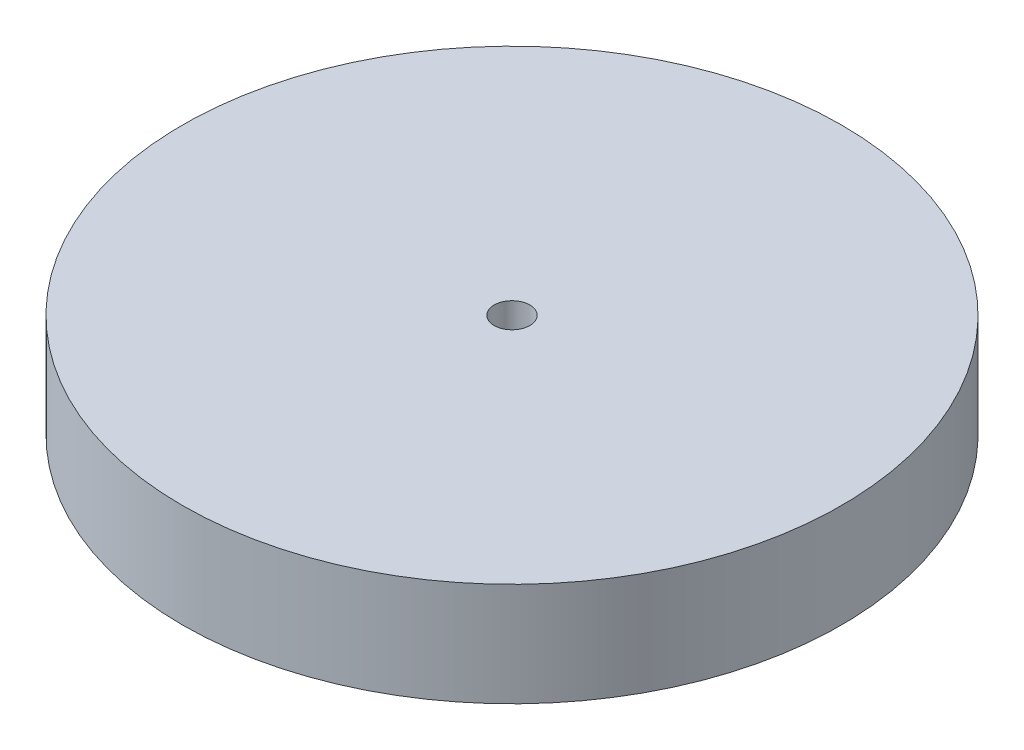
ISO-10303-21;
HEADER;
FILE_DESCRIPTION(('STEP AP214'),'2;1');
FILE_NAME('part.step','',(''),(''),'','','');
FILE_SCHEMA(('AUTOMOTIVE_DESIGN { 1 0 10303 214 1 1 1 1 }'));
ENDSEC;
DATA;
#1=APPLICATION_CONTEXT('core data for automotive mechanical design processes');
#2=APPLICATION_PROTOCOL_DEFINITION('international standard','automotive_design',2000,#1);
#3=PRODUCT_CONTEXT('',#1,'mechanical');
#4=PRODUCT('Part','Part','',(#3));
#5=PRODUCT_RELATED_PRODUCT_CATEGORY('part','',(#4));
#6=PRODUCT_DEFINITION_FORMATION('','',#4);
#7=PRODUCT_DEFINITION_CONTEXT('part definition',#1,'design');
#8=PRODUCT_DEFINITION('design','',#6,#7);
#9=PRODUCT_DEFINITION_SHAPE('','',#8);
#10=(LENGTH_UNIT() NAMED_UNIT(*) SI_UNIT(.MILLI.,.METRE.));
#11=(NAMED_UNIT(*) PLANE_ANGLE_UNIT() SI_UNIT($,.RADIAN.));
#12=(NAMED_UNIT(*) SI_UNIT($,.STERADIAN.) SOLID_ANGLE_UNIT());
#13=UNCERTAINTY_MEASURE_WITH_UNIT(LENGTH_MEASURE(1.E-05),#10,'distance_accuracy_value','');
#14=(GEOMETRIC_REPRESENTATION_CONTEXT(3) GLOBAL_UNCERTAINTY_ASSIGNED_CONTEXT((#13)) GLOBAL_UNIT_ASSIGNED_CONTEXT((#10,
#11,#12)) REPRESENTATION_CONTEXT('',''));
#15=CARTESIAN_POINT('',(0.,0.,0.));
#16=DIRECTION('',(0.,0.,1.));
#17=DIRECTION('',(1.,0.,0.));
#18=AXIS2_PLACEMENT_3D('',#15,#16,#17);
#19=CARTESIAN_POINT('',(0.,19.,0.));
#20=DIRECTION('',(0.,-1.,0.));
#21=DIRECTION('',(0.,0.,-1.));
#22=AXIS2_PLACEMENT_3D('',#19,#20,#21);
#23=CYLINDRICAL_SURFACE('',#22,60.5);
#24=CARTESIAN_POINT('',(0.,19.,0.));
#25=DIRECTION('',(0.,1.,0.));
#26=DIRECTION('',(0.,0.,1.));
#27=AXIS2_PLACEMENT_3D('',#24,#25,#26);
#28=CIRCLE('',#27,60.5);
#29=CARTESIAN_POINT('',(0.,19.,60.5));
#30=VERTEX_POINT('',#29);
#31=EDGE_CURVE('E10',#30,#30,#28,.T.);
#32=ORIENTED_EDGE('',*,*,#31,.F.);
#33=EDGE_LOOP('',(#32));
#34=FACE_BOUND('',#33,.T.);
#35=CARTESIAN_POINT('',(0.,0.,0.));
#36=DIRECTION('',(0.,1.,0.));
#37=DIRECTION('',(0.,0.,1.));
#38=AXIS2_PLACEMENT_3D('',#35,#36,#37);
#39=CIRCLE('',#38,60.5);
#40=CARTESIAN_POINT('',(0.,0.,60.5));
#41=VERTEX_POINT('',#40);
#42=EDGE_CURVE('E36',#41,#41,#39,.T.);
#43=ORIENTED_EDGE('',*,*,#42,.T.);
#44=EDGE_LOOP('',(#43));
#45=FACE_BOUND('',#44,.T.);
#46=ADVANCED_FACE('F33',(#34,#45),#23,.T.);
#47=CARTESIAN_POINT('',(0.,19.,0.));
#48=DIRECTION('',(0.,1.,0.));
#49=DIRECTION('',(0.,0.,1.));
#50=AXIS2_PLACEMENT_3D('',#47,#48,#49);
#51=PLANE('',#50);
#52=CARTESIAN_POINT('',(0.,19.,0.));
#53=DIRECTION('',(0.,1.,0.));
#54=DIRECTION('',(0.,0.,1.));
#55=AXIS2_PLACEMENT_3D('',#52,#53,#54);
#56=CIRCLE('',#55,3.275);
#57=CARTESIAN_POINT('',(0.,19.,3.275));
#58=VERTEX_POINT('',#57);
#59=EDGE_CURVE('E45',#58,#58,#56,.T.);
#60=ORIENTED_EDGE('',*,*,#59,.F.);
#61=EDGE_LOOP('',(#60));
#62=FACE_BOUND('',#61,.T.);
#63=ORIENTED_EDGE('',*,*,#31,.T.);
#64=EDGE_LOOP('',(#63));
#65=FACE_BOUND('',#64,.T.);
#66=ADVANCED_FACE('F60',(#62,#65),#51,.T.);
#67=CARTESIAN_POINT('',(0.,0.,0.));
#68=DIRECTION('',(0.,1.,0.));
#69=DIRECTION('',(0.,0.,1.));
#70=AXIS2_PLACEMENT_3D('',#67,#68,#69);
#71=PLANE('',#70);
#72=CARTESIAN_POINT('',(0.,0.,0.));
#73=DIRECTION('',(0.,1.,0.));
#74=DIRECTION('',(0.,0.,1.));
#75=AXIS2_PLACEMENT_3D('',#72,#73,#74);
#76=CIRCLE('',#75,3.275);
#77=CARTESIAN_POINT('',(0.,0.,3.275));
#78=VERTEX_POINT('',#77);
#79=EDGE_CURVE('E43',#78,#78,#76,.T.);
#80=ORIENTED_EDGE('',*,*,#79,.T.);
#81=EDGE_LOOP('',(#80));
#82=FACE_BOUND('',#81,.T.);
#83=ORIENTED_EDGE('',*,*,#42,.F.);
#84=EDGE_LOOP('',(#83));
#85=FACE_BOUND('',#84,.T.);
#86=ADVANCED_FACE('F51',(#82,#85),#71,.F.);
#87=CARTESIAN_POINT('',(0.,0.,0.));
#88=DIRECTION('',(0.,1.,0.));
#89=DIRECTION('',(0.,0.,1.));
#90=AXIS2_PLACEMENT_3D('',#87,#88,#89);
#91=CYLINDRICAL_SURFACE('',#90,3.275);
#92=ORIENTED_EDGE('',*,*,#79,.F.);
#93=EDGE_LOOP('',(#92));
#94=FACE_BOUND('',#93,.T.);
#95=ORIENTED_EDGE('',*,*,#59,.T.);
#96=EDGE_LOOP('',(#95));
#97=FACE_BOUND('',#96,.T.);
#98=ADVANCED_FACE('F54',(#94,#97),#91,.F.);
#99=CLOSED_SHELL('',(#46,#66,#86,#98));
#100=MANIFOLD_SOLID_BREP('B2',#99);
#101=ADVANCED_BREP_SHAPE_REPRESENTATION('',(#18,#100),#14);
#102=SHAPE_DEFINITION_REPRESENTATION(#9,#101);
ENDSEC;
END-ISO-10303-21;
